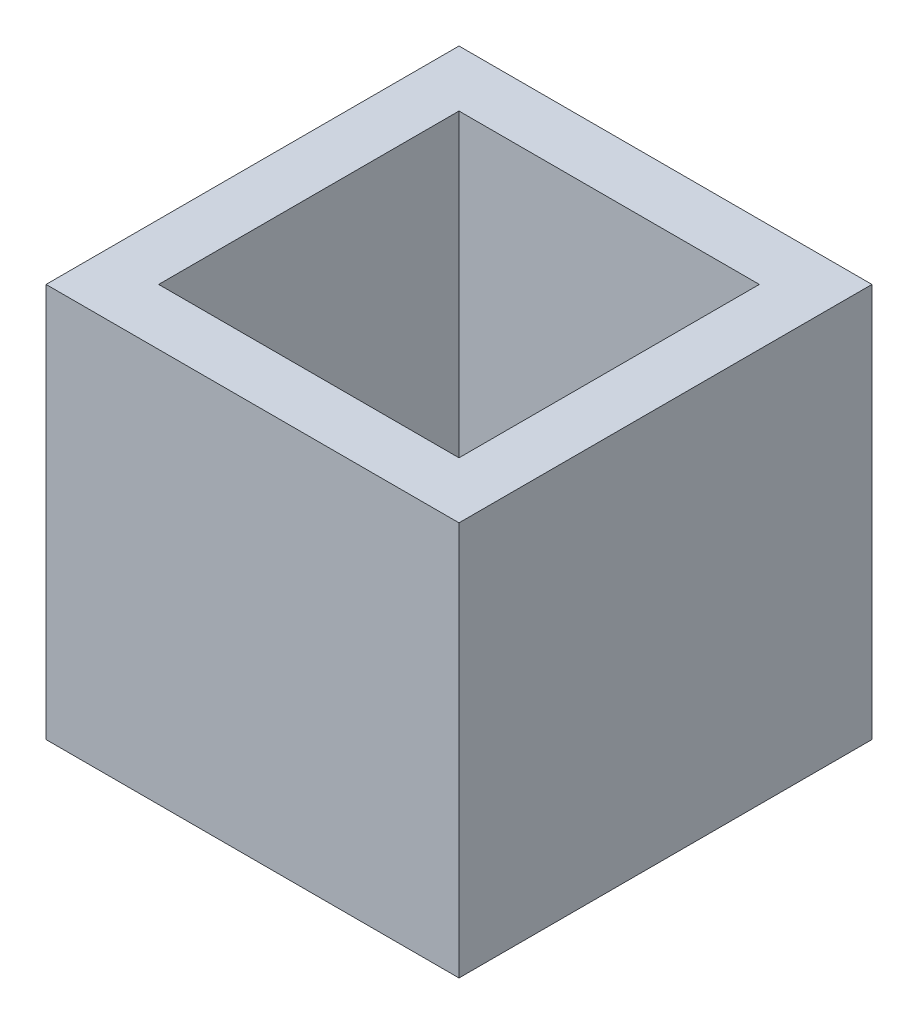
ISO-10303-21;
HEADER;
FILE_DESCRIPTION(('STEP AP214'),'2;1');
FILE_NAME('part.step','',(''),(''),'','','');
FILE_SCHEMA(('AUTOMOTIVE_DESIGN { 1 0 10303 214 1 1 1 1 }'));
ENDSEC;
DATA;
#1=APPLICATION_CONTEXT('core data for automotive mechanical design processes');
#2=APPLICATION_PROTOCOL_DEFINITION('international standard','automotive_design',2000,#1);
#3=PRODUCT_CONTEXT('',#1,'mechanical');
#4=PRODUCT('Part','Part','',(#3));
#5=PRODUCT_RELATED_PRODUCT_CATEGORY('part','',(#4));
#6=PRODUCT_DEFINITION_FORMATION('','',#4);
#7=PRODUCT_DEFINITION_CONTEXT('part definition',#1,'design');
#8=PRODUCT_DEFINITION('design','',#6,#7);
#9=PRODUCT_DEFINITION_SHAPE('','',#8);
#10=(LENGTH_UNIT() NAMED_UNIT(*) SI_UNIT(.MILLI.,.METRE.));
#11=(NAMED_UNIT(*) PLANE_ANGLE_UNIT() SI_UNIT($,.RADIAN.));
#12=(NAMED_UNIT(*) SI_UNIT($,.STERADIAN.) SOLID_ANGLE_UNIT());
#13=UNCERTAINTY_MEASURE_WITH_UNIT(LENGTH_MEASURE(1.E-05),#10,'distance_accuracy_value','');
#14=(GEOMETRIC_REPRESENTATION_CONTEXT(3) GLOBAL_UNCERTAINTY_ASSIGNED_CONTEXT((#13)) GLOBAL_UNIT_ASSIGNED_CONTEXT((#10,
#11,#12)) REPRESENTATION_CONTEXT('',''));
#15=CARTESIAN_POINT('',(0.,0.,0.));
#16=DIRECTION('',(0.,0.,1.));
#17=DIRECTION('',(1.,0.,0.));
#18=AXIS2_PLACEMENT_3D('',#15,#16,#17);
#19=CARTESIAN_POINT('',(6.,10.,-7.27));
#20=DIRECTION('',(0.,-1.,0.));
#21=DIRECTION('',(0.,0.,-1.));
#22=AXIS2_PLACEMENT_3D('',#19,#20,#21);
#23=CYLINDRICAL_SURFACE('',#22,0.625);
#24=CARTESIAN_POINT('',(6.,2.,-7.27));
#25=DIRECTION('',(0.,-1.,0.));
#26=DIRECTION('',(0.,0.,-1.));
#27=AXIS2_PLACEMENT_3D('',#24,#25,#26);
#28=CIRCLE('',#27,0.625);
#29=CARTESIAN_POINT('',(6.,2.,-7.895));
#30=VERTEX_POINT('',#29);
#31=EDGE_CURVE('E178',#30,#30,#28,.T.);
#32=ORIENTED_EDGE('',*,*,#31,.F.);
#33=EDGE_LOOP('',(#32));
#34=FACE_BOUND('',#33,.T.);
#35=CARTESIAN_POINT('',(6.,0.5,-7.27));
#36=DIRECTION('',(0.,-1.,0.));
#37=DIRECTION('',(0.,0.,-1.));
#38=AXIS2_PLACEMENT_3D('',#35,#36,#37);
#39=CIRCLE('',#38,0.625);
#40=CARTESIAN_POINT('',(6.,0.5,-7.895));
#41=VERTEX_POINT('',#40);
#42=EDGE_CURVE('E199',#41,#41,#39,.F.);
#43=ORIENTED_EDGE('',*,*,#42,.F.);
#44=EDGE_LOOP('',(#43));
#45=FACE_BOUND('',#44,.T.);
#46=ADVANCED_FACE('F42',(#34,#45),#23,.F.);
#47=CARTESIAN_POINT('',(6.,10.,-4.73));
#48=DIRECTION('',(0.,-1.,0.));
#49=DIRECTION('',(0.,0.,-1.));
#50=AXIS2_PLACEMENT_3D('',#47,#48,#49);
#51=CYLINDRICAL_SURFACE('',#50,0.625);
#52=CARTESIAN_POINT('',(6.,2.,-4.73));
#53=DIRECTION('',(0.,-1.,0.));
#54=DIRECTION('',(0.,0.,-1.));
#55=AXIS2_PLACEMENT_3D('',#52,#53,#54);
#56=CIRCLE('',#55,0.625);
#57=CARTESIAN_POINT('',(6.,2.,-5.355));
#58=VERTEX_POINT('',#57);
#59=EDGE_CURVE('E46',#58,#58,#56,.T.);
#60=ORIENTED_EDGE('',*,*,#59,.F.);
#61=EDGE_LOOP('',(#60));
#62=FACE_BOUND('',#61,.T.);
#63=CARTESIAN_POINT('',(6.,0.5,-4.73));
#64=DIRECTION('',(0.,-1.,0.));
#65=DIRECTION('',(0.,0.,-1.));
#66=AXIS2_PLACEMENT_3D('',#63,#64,#65);
#67=CIRCLE('',#66,0.625);
#68=CARTESIAN_POINT('',(6.,0.5,-5.355));
#69=VERTEX_POINT('',#68);
#70=EDGE_CURVE('E203',#69,#69,#67,.F.);
#71=ORIENTED_EDGE('',*,*,#70,.F.);
#72=EDGE_LOOP('',(#71));
#73=FACE_BOUND('',#72,.T.);
#74=ADVANCED_FACE('F229',(#62,#73),#51,.F.);
#75=CARTESIAN_POINT('',(0.5,0.,-0.5));
#76=DIRECTION('',(0.,0.,1.));
#77=DIRECTION('',(1.,0.,0.));
#78=AXIS2_PLACEMENT_3D('',#75,#76,#77);
#79=PLANE('',#78);
#80=DIRECTION('',(0.,1.,0.));
#81=VECTOR('',#80,1.);
#82=CARTESIAN_POINT('',(0.5,0.,-0.5));
#83=LINE('',#82,#81);
#84=CARTESIAN_POINT('',(0.5,0.5,-0.5));
#85=VERTEX_POINT('',#84);
#86=CARTESIAN_POINT('',(0.5,11.,-0.5));
#87=VERTEX_POINT('',#86);
#88=EDGE_CURVE('E122',#85,#87,#83,.T.);
#89=ORIENTED_EDGE('',*,*,#88,.F.);
#90=DIRECTION('',(-1.,0.,0.));
#91=VECTOR('',#90,1.);
#92=CARTESIAN_POINT('',(11.5,0.5,-0.5));
#93=LINE('',#92,#91);
#94=CARTESIAN_POINT('',(11.5,0.5,-0.5));
#95=VERTEX_POINT('',#94);
#96=EDGE_CURVE('E112',#95,#85,#93,.T.);
#97=ORIENTED_EDGE('',*,*,#96,.F.);
#98=DIRECTION('',(0.,1.,0.));
#99=VECTOR('',#98,1.);
#100=CARTESIAN_POINT('',(11.5,0.,-0.5));
#101=LINE('',#100,#99);
#102=CARTESIAN_POINT('',(11.5,11.,-0.5));
#103=VERTEX_POINT('',#102);
#104=EDGE_CURVE('E121',#95,#103,#101,.T.);
#105=ORIENTED_EDGE('',*,*,#104,.T.);
#106=DIRECTION('',(1.,0.,0.));
#107=VECTOR('',#106,1.);
#108=CARTESIAN_POINT('',(0.5,11.,-0.5));
#109=LINE('',#108,#107);
#110=EDGE_CURVE('E196',#87,#103,#109,.T.);
#111=ORIENTED_EDGE('',*,*,#110,.F.);
#112=EDGE_LOOP('',(#89,#97,#105,#111));
#113=FACE_BOUND('',#112,.T.);
#114=ADVANCED_FACE('F119',(#113),#79,.T.);
#115=CARTESIAN_POINT('',(0.5,0.,-11.5));
#116=DIRECTION('',(-1.,0.,0.));
#117=DIRECTION('',(0.,0.,1.));
#118=AXIS2_PLACEMENT_3D('',#115,#116,#117);
#119=PLANE('',#118);
#120=DIRECTION('',(0.,1.,0.));
#121=VECTOR('',#120,1.);
#122=CARTESIAN_POINT('',(0.5,0.,-11.5));
#123=LINE('',#122,#121);
#124=CARTESIAN_POINT('',(0.5,0.5,-11.5));
#125=VERTEX_POINT('',#124);
#126=CARTESIAN_POINT('',(0.5,11.,-11.5));
#127=VERTEX_POINT('',#126);
#128=EDGE_CURVE('E135',#125,#127,#123,.T.);
#129=ORIENTED_EDGE('',*,*,#128,.F.);
#130=DIRECTION('',(0.,0.,-1.));
#131=VECTOR('',#130,1.);
#132=CARTESIAN_POINT('',(0.5,0.5,-0.5));
#133=LINE('',#132,#131);
#134=EDGE_CURVE('E124',#85,#125,#133,.T.);
#135=ORIENTED_EDGE('',*,*,#134,.F.);
#136=ORIENTED_EDGE('',*,*,#88,.T.);
#137=DIRECTION('',(0.,0.,1.));
#138=VECTOR('',#137,1.);
#139=CARTESIAN_POINT('',(0.5,11.,-11.5));
#140=LINE('',#139,#138);
#141=EDGE_CURVE('E131',#127,#87,#140,.T.);
#142=ORIENTED_EDGE('',*,*,#141,.F.);
#143=EDGE_LOOP('',(#129,#135,#136,#142));
#144=FACE_BOUND('',#143,.T.);
#145=ADVANCED_FACE('F213',(#144),#119,.T.);
#146=CARTESIAN_POINT('',(11.5,0.,-11.5));
#147=DIRECTION('',(0.,0.,-1.));
#148=DIRECTION('',(-1.,0.,0.));
#149=AXIS2_PLACEMENT_3D('',#146,#147,#148);
#150=PLANE('',#149);
#151=DIRECTION('',(0.,1.,0.));
#152=VECTOR('',#151,1.);
#153=CARTESIAN_POINT('',(11.5,0.,-11.5));
#154=LINE('',#153,#152);
#155=CARTESIAN_POINT('',(11.5,0.5,-11.5));
#156=VERTEX_POINT('',#155);
#157=CARTESIAN_POINT('',(11.5,11.,-11.5));
#158=VERTEX_POINT('',#157);
#159=EDGE_CURVE('E67',#156,#158,#154,.T.);
#160=ORIENTED_EDGE('',*,*,#159,.F.);
#161=DIRECTION('',(1.,0.,0.));
#162=VECTOR('',#161,1.);
#163=CARTESIAN_POINT('',(0.5,0.5,-11.5));
#164=LINE('',#163,#162);
#165=EDGE_CURVE('E60',#125,#156,#164,.T.);
#166=ORIENTED_EDGE('',*,*,#165,.F.);
#167=ORIENTED_EDGE('',*,*,#128,.T.);
#168=DIRECTION('',(-1.,0.,0.));
#169=VECTOR('',#168,1.);
#170=CARTESIAN_POINT('',(11.5,11.,-11.5));
#171=LINE('',#170,#169);
#172=EDGE_CURVE('E138',#158,#127,#171,.T.);
#173=ORIENTED_EDGE('',*,*,#172,.F.);
#174=EDGE_LOOP('',(#160,#166,#167,#173));
#175=FACE_BOUND('',#174,.T.);
#176=ADVANCED_FACE('F212',(#175),#150,.T.);
#177=CARTESIAN_POINT('',(11.5,0.,-0.5));
#178=DIRECTION('',(1.,0.,0.));
#179=DIRECTION('',(0.,0.,-1.));
#180=AXIS2_PLACEMENT_3D('',#177,#178,#179);
#181=PLANE('',#180);
#182=ORIENTED_EDGE('',*,*,#104,.F.);
#183=DIRECTION('',(0.,0.,1.));
#184=VECTOR('',#183,1.);
#185=CARTESIAN_POINT('',(11.5,0.5,-11.5));
#186=LINE('',#185,#184);
#187=EDGE_CURVE('E108',#156,#95,#186,.T.);
#188=ORIENTED_EDGE('',*,*,#187,.F.);
#189=ORIENTED_EDGE('',*,*,#159,.T.);
#190=DIRECTION('',(0.,0.,-1.));
#191=VECTOR('',#190,1.);
#192=CARTESIAN_POINT('',(11.5,11.,-0.5));
#193=LINE('',#192,#191);
#194=EDGE_CURVE('E128',#103,#158,#193,.T.);
#195=ORIENTED_EDGE('',*,*,#194,.F.);
#196=EDGE_LOOP('',(#182,#188,#189,#195));
#197=FACE_BOUND('',#196,.T.);
#198=ADVANCED_FACE('F126',(#197),#181,.T.);
#199=CARTESIAN_POINT('',(0.,11.,0.));
#200=DIRECTION('',(0.,-1.,0.));
#201=DIRECTION('',(0.,0.,-1.));
#202=AXIS2_PLACEMENT_3D('',#199,#200,#201);
#203=PLANE('',#202);
#204=DIRECTION('',(0.,0.,1.));
#205=VECTOR('',#204,1.);
#206=CARTESIAN_POINT('',(2.,11.,0.));
#207=LINE('',#206,#205);
#208=CARTESIAN_POINT('',(2.,11.,-10.));
#209=VERTEX_POINT('',#208);
#210=CARTESIAN_POINT('',(2.,11.,-2.));
#211=VERTEX_POINT('',#210);
#212=EDGE_CURVE('E167',#209,#211,#207,.T.);
#213=ORIENTED_EDGE('',*,*,#212,.F.);
#214=DIRECTION('',(-1.,0.,0.));
#215=VECTOR('',#214,1.);
#216=CARTESIAN_POINT('',(0.,11.,-10.));
#217=LINE('',#216,#215);
#218=CARTESIAN_POINT('',(10.,11.,-10.));
#219=VERTEX_POINT('',#218);
#220=EDGE_CURVE('E152',#219,#209,#217,.T.);
#221=ORIENTED_EDGE('',*,*,#220,.F.);
#222=DIRECTION('',(0.,0.,-1.));
#223=VECTOR('',#222,1.);
#224=CARTESIAN_POINT('',(10.,11.,0.));
#225=LINE('',#224,#223);
#226=CARTESIAN_POINT('',(10.,11.,-2.));
#227=VERTEX_POINT('',#226);
#228=EDGE_CURVE('E173',#227,#219,#225,.T.);
#229=ORIENTED_EDGE('',*,*,#228,.F.);
#230=DIRECTION('',(1.,0.,0.));
#231=VECTOR('',#230,1.);
#232=CARTESIAN_POINT('',(0.,11.,-2.));
#233=LINE('',#232,#231);
#234=EDGE_CURVE('E170',#211,#227,#233,.T.);
#235=ORIENTED_EDGE('',*,*,#234,.F.);
#236=EDGE_LOOP('',(#213,#221,#229,#235));
#237=FACE_BOUND('',#236,.T.);
#238=ORIENTED_EDGE('',*,*,#110,.T.);
#239=ORIENTED_EDGE('',*,*,#194,.T.);
#240=ORIENTED_EDGE('',*,*,#172,.T.);
#241=ORIENTED_EDGE('',*,*,#141,.T.);
#242=EDGE_LOOP('',(#238,#239,#240,#241));
#243=FACE_BOUND('',#242,.T.);
#244=ADVANCED_FACE('F44',(#237,#243),#203,.F.);
#245=CARTESIAN_POINT('',(2.,11.,0.));
#246=DIRECTION('',(1.,0.,0.));
#247=DIRECTION('',(0.,0.,-1.));
#248=AXIS2_PLACEMENT_3D('',#245,#246,#247);
#249=PLANE('',#248);
#250=DIRECTION('',(0.,0.,1.));
#251=VECTOR('',#250,1.);
#252=CARTESIAN_POINT('',(2.,2.,0.));
#253=LINE('',#252,#251);
#254=CARTESIAN_POINT('',(2.,2.,-10.));
#255=VERTEX_POINT('',#254);
#256=CARTESIAN_POINT('',(2.,2.,-2.));
#257=VERTEX_POINT('',#256);
#258=EDGE_CURVE('E142',#255,#257,#253,.T.);
#259=ORIENTED_EDGE('',*,*,#258,.F.);
#260=DIRECTION('',(0.,-1.,0.));
#261=VECTOR('',#260,1.);
#262=CARTESIAN_POINT('',(2.,11.,-10.));
#263=LINE('',#262,#261);
#264=EDGE_CURVE('E147',#209,#255,#263,.T.);
#265=ORIENTED_EDGE('',*,*,#264,.F.);
#266=ORIENTED_EDGE('',*,*,#212,.T.);
#267=DIRECTION('',(0.,-1.,0.));
#268=VECTOR('',#267,1.);
#269=CARTESIAN_POINT('',(2.,11.,-2.));
#270=LINE('',#269,#268);
#271=EDGE_CURVE('E11',#211,#257,#270,.T.);
#272=ORIENTED_EDGE('',*,*,#271,.T.);
#273=EDGE_LOOP('',(#259,#265,#266,#272));
#274=FACE_BOUND('',#273,.T.);
#275=ADVANCED_FACE('F216',(#274),#249,.T.);
#276=CARTESIAN_POINT('',(0.,11.,-2.));
#277=DIRECTION('',(0.,0.,-1.));
#278=DIRECTION('',(-1.,0.,0.));
#279=AXIS2_PLACEMENT_3D('',#276,#277,#278);
#280=PLANE('',#279);
#281=DIRECTION('',(1.,0.,0.));
#282=VECTOR('',#281,1.);
#283=CARTESIAN_POINT('',(0.,2.,-2.));
#284=LINE('',#283,#282);
#285=CARTESIAN_POINT('',(10.,2.,-2.));
#286=VERTEX_POINT('',#285);
#287=EDGE_CURVE('E145',#257,#286,#284,.T.);
#288=ORIENTED_EDGE('',*,*,#287,.F.);
#289=ORIENTED_EDGE('',*,*,#271,.F.);
#290=ORIENTED_EDGE('',*,*,#234,.T.);
#291=DIRECTION('',(0.,-1.,0.));
#292=VECTOR('',#291,1.);
#293=CARTESIAN_POINT('',(10.,11.,-2.));
#294=LINE('',#293,#292);
#295=EDGE_CURVE('E52',#227,#286,#294,.T.);
#296=ORIENTED_EDGE('',*,*,#295,.T.);
#297=EDGE_LOOP('',(#288,#289,#290,#296));
#298=FACE_BOUND('',#297,.T.);
#299=ADVANCED_FACE('F223',(#298),#280,.T.);
#300=CARTESIAN_POINT('',(10.,11.,0.));
#301=DIRECTION('',(-1.,0.,0.));
#302=DIRECTION('',(0.,0.,1.));
#303=AXIS2_PLACEMENT_3D('',#300,#301,#302);
#304=PLANE('',#303);
#305=DIRECTION('',(0.,0.,-1.));
#306=VECTOR('',#305,1.);
#307=CARTESIAN_POINT('',(10.,2.,0.));
#308=LINE('',#307,#306);
#309=CARTESIAN_POINT('',(10.,2.,-10.));
#310=VERTEX_POINT('',#309);
#311=EDGE_CURVE('E155',#286,#310,#308,.T.);
#312=ORIENTED_EDGE('',*,*,#311,.F.);
#313=ORIENTED_EDGE('',*,*,#295,.F.);
#314=ORIENTED_EDGE('',*,*,#228,.T.);
#315=DIRECTION('',(0.,-1.,0.));
#316=VECTOR('',#315,1.);
#317=CARTESIAN_POINT('',(10.,11.,-10.));
#318=LINE('',#317,#316);
#319=EDGE_CURVE('E151',#219,#310,#318,.T.);
#320=ORIENTED_EDGE('',*,*,#319,.T.);
#321=EDGE_LOOP('',(#312,#313,#314,#320));
#322=FACE_BOUND('',#321,.T.);
#323=ADVANCED_FACE('F242',(#322),#304,.T.);
#324=CARTESIAN_POINT('',(0.,11.,-10.));
#325=DIRECTION('',(0.,0.,1.));
#326=DIRECTION('',(1.,0.,0.));
#327=AXIS2_PLACEMENT_3D('',#324,#325,#326);
#328=PLANE('',#327);
#329=DIRECTION('',(-1.,0.,0.));
#330=VECTOR('',#329,1.);
#331=CARTESIAN_POINT('',(0.,2.,-10.));
#332=LINE('',#331,#330);
#333=EDGE_CURVE('E161',#310,#255,#332,.T.);
#334=ORIENTED_EDGE('',*,*,#333,.F.);
#335=ORIENTED_EDGE('',*,*,#319,.F.);
#336=ORIENTED_EDGE('',*,*,#220,.T.);
#337=ORIENTED_EDGE('',*,*,#264,.T.);
#338=EDGE_LOOP('',(#334,#335,#336,#337));
#339=FACE_BOUND('',#338,.T.);
#340=ADVANCED_FACE('F246',(#339),#328,.T.);
#341=CARTESIAN_POINT('',(0.,2.,0.));
#342=DIRECTION('',(0.,-1.,0.));
#343=DIRECTION('',(0.,0.,-1.));
#344=AXIS2_PLACEMENT_3D('',#341,#342,#343);
#345=PLANE('',#344);
#346=ORIENTED_EDGE('',*,*,#59,.T.);
#347=EDGE_LOOP('',(#346));
#348=FACE_BOUND('',#347,.T.);
#349=ORIENTED_EDGE('',*,*,#31,.T.);
#350=EDGE_LOOP('',(#349));
#351=FACE_BOUND('',#350,.T.);
#352=ORIENTED_EDGE('',*,*,#258,.T.);
#353=ORIENTED_EDGE('',*,*,#287,.T.);
#354=ORIENTED_EDGE('',*,*,#311,.T.);
#355=ORIENTED_EDGE('',*,*,#333,.T.);
#356=EDGE_LOOP('',(#352,#353,#354,#355));
#357=FACE_BOUND('',#356,.T.);
#358=ADVANCED_FACE('F249',(#348,#351,#357),#345,.F.);
#359=CARTESIAN_POINT('',(0.,0.5,0.));
#360=DIRECTION('',(0.,-1.,0.));
#361=DIRECTION('',(0.,0.,-1.));
#362=AXIS2_PLACEMENT_3D('',#359,#360,#361);
#363=PLANE('',#362);
#364=ORIENTED_EDGE('',*,*,#165,.T.);
#365=ORIENTED_EDGE('',*,*,#187,.T.);
#366=ORIENTED_EDGE('',*,*,#96,.T.);
#367=ORIENTED_EDGE('',*,*,#134,.T.);
#368=EDGE_LOOP('',(#364,#365,#366,#367));
#369=FACE_BOUND('',#368,.T.);
#370=ORIENTED_EDGE('',*,*,#70,.T.);
#371=EDGE_LOOP('',(#370));
#372=FACE_BOUND('',#371,.T.);
#373=ORIENTED_EDGE('',*,*,#42,.T.);
#374=EDGE_LOOP('',(#373));
#375=FACE_BOUND('',#374,.T.);
#376=ADVANCED_FACE('F110',(#369,#372,#375),#363,.T.);
#377=CLOSED_SHELL('',(#46,#74,#114,#145,#176,#198,#244,#275,#299,#323,#340,#358,#376));
#378=MANIFOLD_SOLID_BREP('B2',#377);
#379=ADVANCED_BREP_SHAPE_REPRESENTATION('',(#18,#378),#14);
#380=SHAPE_DEFINITION_REPRESENTATION(#9,#379);
ENDSEC;
END-ISO-10303-21;
